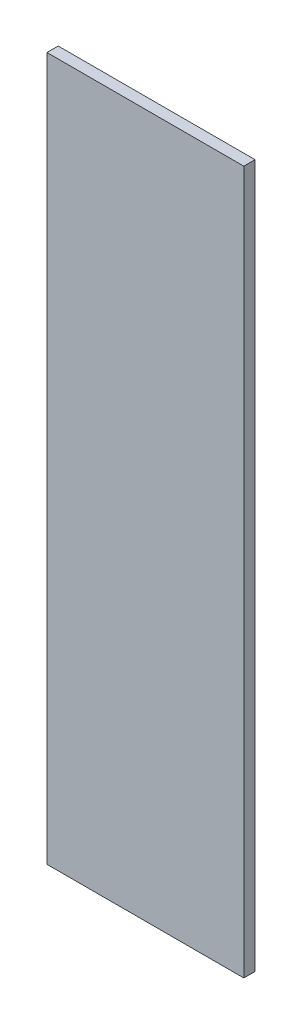
ISO-10303-21;
HEADER;
FILE_DESCRIPTION(('STEP AP214'),'2;1');
FILE_NAME('part.step','',(''),(''),'','','');
FILE_SCHEMA(('AUTOMOTIVE_DESIGN { 1 0 10303 214 1 1 1 1 }'));
ENDSEC;
DATA;
#1=APPLICATION_CONTEXT('core data for automotive mechanical design processes');
#2=APPLICATION_PROTOCOL_DEFINITION('international standard','automotive_design',2000,#1);
#3=PRODUCT_CONTEXT('',#1,'mechanical');
#4=PRODUCT('Part','Part','',(#3));
#5=PRODUCT_RELATED_PRODUCT_CATEGORY('part','',(#4));
#6=PRODUCT_DEFINITION_FORMATION('','',#4);
#7=PRODUCT_DEFINITION_CONTEXT('part definition',#1,'design');
#8=PRODUCT_DEFINITION('design','',#6,#7);
#9=PRODUCT_DEFINITION_SHAPE('','',#8);
#10=(LENGTH_UNIT() NAMED_UNIT(*) SI_UNIT(.MILLI.,.METRE.));
#11=(NAMED_UNIT(*) PLANE_ANGLE_UNIT() SI_UNIT($,.RADIAN.));
#12=(NAMED_UNIT(*) SI_UNIT($,.STERADIAN.) SOLID_ANGLE_UNIT());
#13=UNCERTAINTY_MEASURE_WITH_UNIT(LENGTH_MEASURE(1.E-05),#10,'distance_accuracy_value','');
#14=(GEOMETRIC_REPRESENTATION_CONTEXT(3) GLOBAL_UNCERTAINTY_ASSIGNED_CONTEXT((#13)) GLOBAL_UNIT_ASSIGNED_CONTEXT((#10,
#11,#12)) REPRESENTATION_CONTEXT('',''));
#15=CARTESIAN_POINT('',(0.,0.,0.));
#16=DIRECTION('',(0.,0.,1.));
#17=DIRECTION('',(1.,0.,0.));
#18=AXIS2_PLACEMENT_3D('',#15,#16,#17);
#19=CARTESIAN_POINT('',(-14.,0.,1.6));
#20=DIRECTION('',(0.,1.,0.));
#21=DIRECTION('',(0.,0.,1.));
#22=AXIS2_PLACEMENT_3D('',#19,#20,#21);
#23=PLANE('',#22);
#24=DIRECTION('',(1.,0.,0.));
#25=VECTOR('',#24,1.);
#26=CARTESIAN_POINT('',(-14.,0.,0.));
#27=LINE('',#26,#25);
#28=CARTESIAN_POINT('',(-14.,0.,0.));
#29=VERTEX_POINT('',#28);
#30=CARTESIAN_POINT('',(14.,0.,0.));
#31=VERTEX_POINT('',#30);
#32=EDGE_CURVE('E102',#29,#31,#27,.T.);
#33=ORIENTED_EDGE('',*,*,#32,.T.);
#34=DIRECTION('',(0.,0.,-1.));
#35=VECTOR('',#34,1.);
#36=CARTESIAN_POINT('',(14.,0.,1.6));
#37=LINE('',#36,#35);
#38=CARTESIAN_POINT('',(14.,0.,1.6));
#39=VERTEX_POINT('',#38);
#40=EDGE_CURVE('E11',#39,#31,#37,.T.);
#41=ORIENTED_EDGE('',*,*,#40,.F.);
#42=DIRECTION('',(1.,0.,0.));
#43=VECTOR('',#42,1.);
#44=CARTESIAN_POINT('',(-14.,0.,1.6));
#45=LINE('',#44,#43);
#46=CARTESIAN_POINT('',(-14.,0.,1.6));
#47=VERTEX_POINT('',#46);
#48=EDGE_CURVE('E88',#47,#39,#45,.T.);
#49=ORIENTED_EDGE('',*,*,#48,.F.);
#50=DIRECTION('',(0.,0.,-1.));
#51=VECTOR('',#50,1.);
#52=CARTESIAN_POINT('',(-14.,0.,1.6));
#53=LINE('',#52,#51);
#54=EDGE_CURVE('E55',#47,#29,#53,.T.);
#55=ORIENTED_EDGE('',*,*,#54,.T.);
#56=EDGE_LOOP('',(#33,#41,#49,#55));
#57=FACE_BOUND('',#56,.T.);
#58=ADVANCED_FACE('F39',(#57),#23,.F.);
#59=CARTESIAN_POINT('',(14.,0.,1.6));
#60=DIRECTION('',(-1.,0.,0.));
#61=DIRECTION('',(0.,0.,1.));
#62=AXIS2_PLACEMENT_3D('',#59,#60,#61);
#63=PLANE('',#62);
#64=DIRECTION('',(0.,1.,0.));
#65=VECTOR('',#64,1.);
#66=CARTESIAN_POINT('',(14.,0.,0.));
#67=LINE('',#66,#65);
#68=CARTESIAN_POINT('',(14.,100.,0.));
#69=VERTEX_POINT('',#68);
#70=EDGE_CURVE('E93',#31,#69,#67,.T.);
#71=ORIENTED_EDGE('',*,*,#70,.T.);
#72=DIRECTION('',(0.,0.,-1.));
#73=VECTOR('',#72,1.);
#74=CARTESIAN_POINT('',(14.,100.,1.6));
#75=LINE('',#74,#73);
#76=CARTESIAN_POINT('',(14.,100.,1.6));
#77=VERTEX_POINT('',#76);
#78=EDGE_CURVE('E47',#77,#69,#75,.T.);
#79=ORIENTED_EDGE('',*,*,#78,.F.);
#80=DIRECTION('',(0.,1.,0.));
#81=VECTOR('',#80,1.);
#82=CARTESIAN_POINT('',(14.,0.,1.6));
#83=LINE('',#82,#81);
#84=EDGE_CURVE('E80',#39,#77,#83,.T.);
#85=ORIENTED_EDGE('',*,*,#84,.F.);
#86=ORIENTED_EDGE('',*,*,#40,.T.);
#87=EDGE_LOOP('',(#71,#79,#85,#86));
#88=FACE_BOUND('',#87,.T.);
#89=ADVANCED_FACE('F92',(#88),#63,.F.);
#90=CARTESIAN_POINT('',(-14.,100.,1.6));
#91=DIRECTION('',(0.,1.,0.));
#92=DIRECTION('',(0.,0.,1.));
#93=AXIS2_PLACEMENT_3D('',#90,#91,#92);
#94=PLANE('',#93);
#95=DIRECTION('',(1.,0.,0.));
#96=VECTOR('',#95,1.);
#97=CARTESIAN_POINT('',(-14.,100.,0.));
#98=LINE('',#97,#96);
#99=CARTESIAN_POINT('',(-14.,100.,0.));
#100=VERTEX_POINT('',#99);
#101=EDGE_CURVE('E105',#100,#69,#98,.T.);
#102=ORIENTED_EDGE('',*,*,#101,.F.);
#103=DIRECTION('',(0.,0.,-1.));
#104=VECTOR('',#103,1.);
#105=CARTESIAN_POINT('',(-14.,100.,1.6));
#106=LINE('',#105,#104);
#107=CARTESIAN_POINT('',(-14.,100.,1.6));
#108=VERTEX_POINT('',#107);
#109=EDGE_CURVE('E69',#108,#100,#106,.T.);
#110=ORIENTED_EDGE('',*,*,#109,.F.);
#111=DIRECTION('',(1.,0.,0.));
#112=VECTOR('',#111,1.);
#113=CARTESIAN_POINT('',(-14.,100.,1.6));
#114=LINE('',#113,#112);
#115=EDGE_CURVE('E87',#108,#77,#114,.T.);
#116=ORIENTED_EDGE('',*,*,#115,.T.);
#117=ORIENTED_EDGE('',*,*,#78,.T.);
#118=EDGE_LOOP('',(#102,#110,#116,#117));
#119=FACE_BOUND('',#118,.T.);
#120=ADVANCED_FACE('F96',(#119),#94,.T.);
#121=CARTESIAN_POINT('',(-14.,0.,1.6));
#122=DIRECTION('',(-1.,0.,0.));
#123=DIRECTION('',(0.,0.,1.));
#124=AXIS2_PLACEMENT_3D('',#121,#122,#123);
#125=PLANE('',#124);
#126=DIRECTION('',(0.,1.,0.));
#127=VECTOR('',#126,1.);
#128=CARTESIAN_POINT('',(-14.,0.,0.));
#129=LINE('',#128,#127);
#130=EDGE_CURVE('E107',#29,#100,#129,.T.);
#131=ORIENTED_EDGE('',*,*,#130,.F.);
#132=ORIENTED_EDGE('',*,*,#54,.F.);
#133=DIRECTION('',(0.,1.,0.));
#134=VECTOR('',#133,1.);
#135=CARTESIAN_POINT('',(-14.,0.,1.6));
#136=LINE('',#135,#134);
#137=EDGE_CURVE('E97',#47,#108,#136,.T.);
#138=ORIENTED_EDGE('',*,*,#137,.T.);
#139=ORIENTED_EDGE('',*,*,#109,.T.);
#140=EDGE_LOOP('',(#131,#132,#138,#139));
#141=FACE_BOUND('',#140,.T.);
#142=ADVANCED_FACE('F113',(#141),#125,.T.);
#143=CARTESIAN_POINT('',(0.,0.,1.6));
#144=DIRECTION('',(0.,0.,1.));
#145=DIRECTION('',(1.,0.,0.));
#146=AXIS2_PLACEMENT_3D('',#143,#144,#145);
#147=PLANE('',#146);
#148=ORIENTED_EDGE('',*,*,#48,.T.);
#149=ORIENTED_EDGE('',*,*,#84,.T.);
#150=ORIENTED_EDGE('',*,*,#115,.F.);
#151=ORIENTED_EDGE('',*,*,#137,.F.);
#152=EDGE_LOOP('',(#148,#149,#150,#151));
#153=FACE_BOUND('',#152,.T.);
#154=ADVANCED_FACE('F84',(#153),#147,.T.);
#155=CARTESIAN_POINT('',(0.,0.,0.));
#156=DIRECTION('',(0.,0.,1.));
#157=DIRECTION('',(1.,0.,0.));
#158=AXIS2_PLACEMENT_3D('',#155,#156,#157);
#159=PLANE('',#158);
#160=ORIENTED_EDGE('',*,*,#32,.F.);
#161=ORIENTED_EDGE('',*,*,#130,.T.);
#162=ORIENTED_EDGE('',*,*,#101,.T.);
#163=ORIENTED_EDGE('',*,*,#70,.F.);
#164=EDGE_LOOP('',(#160,#161,#162,#163));
#165=FACE_BOUND('',#164,.T.);
#166=ADVANCED_FACE('F112',(#165),#159,.F.);
#167=CLOSED_SHELL('',(#58,#89,#120,#142,#154,#166));
#168=MANIFOLD_SOLID_BREP('B2',#167);
#169=ADVANCED_BREP_SHAPE_REPRESENTATION('',(#18,#168),#14);
#170=SHAPE_DEFINITION_REPRESENTATION(#9,#169);
ENDSEC;
END-ISO-10303-21;
